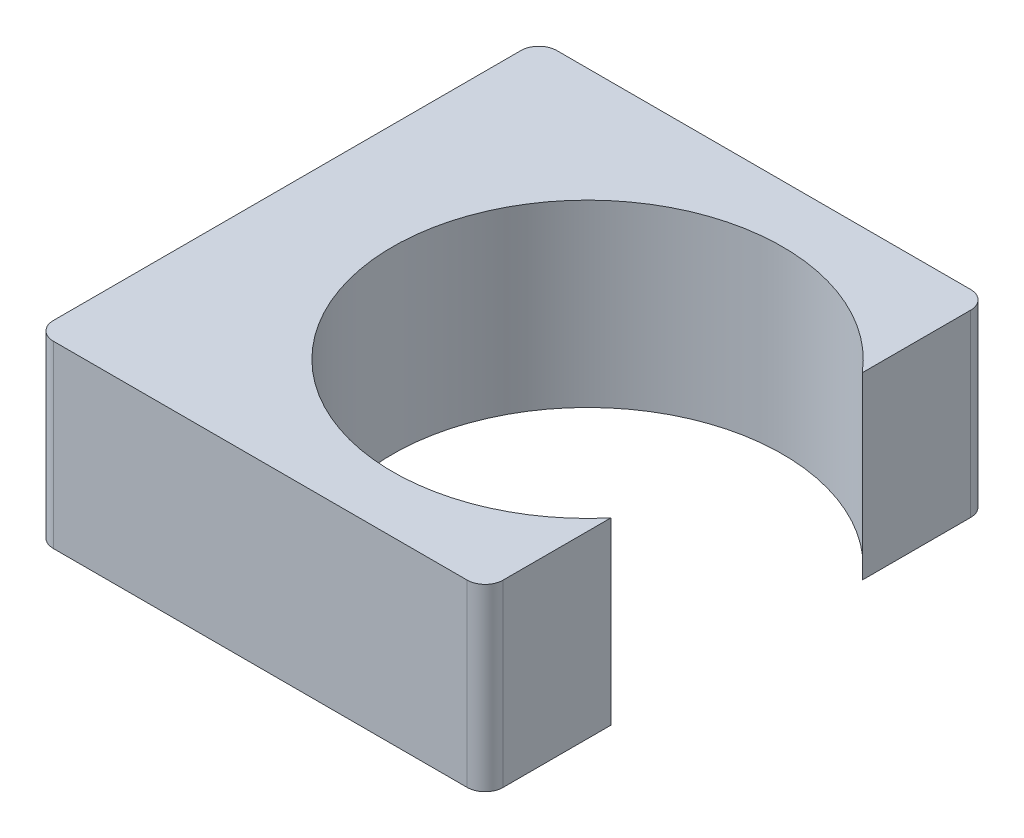
ISO-10303-21;
HEADER;
FILE_DESCRIPTION(('STEP AP214'),'2;1');
FILE_NAME('part.step','',(''),(''),'','','');
FILE_SCHEMA(('AUTOMOTIVE_DESIGN { 1 0 10303 214 1 1 1 1 }'));
ENDSEC;
DATA;
#1=APPLICATION_CONTEXT('core data for automotive mechanical design processes');
#2=APPLICATION_PROTOCOL_DEFINITION('international standard','automotive_design',2000,#1);
#3=PRODUCT_CONTEXT('',#1,'mechanical');
#4=PRODUCT('Part','Part','',(#3));
#5=PRODUCT_RELATED_PRODUCT_CATEGORY('part','',(#4));
#6=PRODUCT_DEFINITION_FORMATION('','',#4);
#7=PRODUCT_DEFINITION_CONTEXT('part definition',#1,'design');
#8=PRODUCT_DEFINITION('design','',#6,#7);
#9=PRODUCT_DEFINITION_SHAPE('','',#8);
#10=(LENGTH_UNIT() NAMED_UNIT(*) SI_UNIT(.MILLI.,.METRE.));
#11=(NAMED_UNIT(*) PLANE_ANGLE_UNIT() SI_UNIT($,.RADIAN.));
#12=(NAMED_UNIT(*) SI_UNIT($,.STERADIAN.) SOLID_ANGLE_UNIT());
#13=UNCERTAINTY_MEASURE_WITH_UNIT(LENGTH_MEASURE(1.E-05),#10,'distance_accuracy_value','');
#14=(GEOMETRIC_REPRESENTATION_CONTEXT(3) GLOBAL_UNCERTAINTY_ASSIGNED_CONTEXT((#13)) GLOBAL_UNIT_ASSIGNED_CONTEXT((#10,
#11,#12)) REPRESENTATION_CONTEXT('',''));
#15=CARTESIAN_POINT('',(0.,0.,0.));
#16=DIRECTION('',(0.,0.,1.));
#17=DIRECTION('',(1.,0.,0.));
#18=AXIS2_PLACEMENT_3D('',#15,#16,#17);
#19=CARTESIAN_POINT('',(0.,25.4,-35.6413674857204));
#20=DIRECTION('',(0.,0.,1.));
#21=DIRECTION('',(1.,0.,0.));
#22=AXIS2_PLACEMENT_3D('',#19,#20,#21);
#23=PLANE('',#22);
#24=DIRECTION('',(-1.,0.,0.));
#25=VECTOR('',#24,1.);
#26=CARTESIAN_POINT('',(0.,0.,-35.6413674857204));
#27=LINE('',#26,#25);
#28=CARTESIAN_POINT('',(18.5336586112377,0.,-35.6413674857204));
#29=VERTEX_POINT('',#28);
#30=CARTESIAN_POINT('',(-39.9904820796406,0.,-35.6413674857204));
#31=VERTEX_POINT('',#30);
#32=EDGE_CURVE('E152',#29,#31,#27,.T.);
#33=ORIENTED_EDGE('',*,*,#32,.T.);
#34=DIRECTION('',(0.,-1.,0.));
#35=VECTOR('',#34,1.);
#36=CARTESIAN_POINT('',(-39.9904820796406,25.4,-35.6413674857204));
#37=LINE('',#36,#35);
#38=CARTESIAN_POINT('',(-39.9904820796406,25.4,-35.6413674857204));
#39=VERTEX_POINT('',#38);
#40=EDGE_CURVE('E11',#39,#31,#37,.T.);
#41=ORIENTED_EDGE('',*,*,#40,.F.);
#42=DIRECTION('',(-1.,0.,0.));
#43=VECTOR('',#42,1.);
#44=CARTESIAN_POINT('',(0.,25.4,-35.6413674857204));
#45=LINE('',#44,#43);
#46=CARTESIAN_POINT('',(18.5336586112377,25.4,-35.6413674857204));
#47=VERTEX_POINT('',#46);
#48=EDGE_CURVE('E178',#47,#39,#45,.T.);
#49=ORIENTED_EDGE('',*,*,#48,.F.);
#50=DIRECTION('',(0.,-1.,0.));
#51=VECTOR('',#50,1.);
#52=CARTESIAN_POINT('',(18.5336586112377,25.4,-35.6413674857204));
#53=LINE('',#52,#51);
#54=EDGE_CURVE('E57',#47,#29,#53,.T.);
#55=ORIENTED_EDGE('',*,*,#54,.T.);
#56=EDGE_LOOP('',(#33,#41,#49,#55));
#57=FACE_BOUND('',#56,.T.);
#58=ADVANCED_FACE('F41',(#57),#23,.F.);
#59=CARTESIAN_POINT('',(-39.9904820796406,25.4,-33.1013674857204));
#60=DIRECTION('',(0.,-1.,0.));
#61=DIRECTION('',(0.,0.,-1.));
#62=AXIS2_PLACEMENT_3D('',#59,#60,#61);
#63=CYLINDRICAL_SURFACE('',#62,2.54);
#64=CARTESIAN_POINT('',(-39.9904820796406,0.,-33.1013674857204));
#65=DIRECTION('',(0.,1.,0.));
#66=DIRECTION('',(0.,0.,1.));
#67=AXIS2_PLACEMENT_3D('',#64,#65,#66);
#68=CIRCLE('',#67,2.54);
#69=CARTESIAN_POINT('',(-42.5304820796406,0.,-33.1013674857203));
#70=VERTEX_POINT('',#69);
#71=EDGE_CURVE('E154',#31,#70,#68,.T.);
#72=ORIENTED_EDGE('',*,*,#71,.T.);
#73=DIRECTION('',(0.,-1.,0.));
#74=VECTOR('',#73,1.);
#75=CARTESIAN_POINT('',(-42.5304820796406,25.4,-33.1013674857203));
#76=LINE('',#75,#74);
#77=CARTESIAN_POINT('',(-42.5304820796406,25.4,-33.1013674857203));
#78=VERTEX_POINT('',#77);
#79=EDGE_CURVE('E49',#78,#70,#76,.T.);
#80=ORIENTED_EDGE('',*,*,#79,.F.);
#81=CARTESIAN_POINT('',(-39.9904820796406,25.4,-33.1013674857204));
#82=DIRECTION('',(0.,1.,0.));
#83=DIRECTION('',(0.,0.,1.));
#84=AXIS2_PLACEMENT_3D('',#81,#82,#83);
#85=CIRCLE('',#84,2.54);
#86=EDGE_CURVE('E102',#39,#78,#85,.T.);
#87=ORIENTED_EDGE('',*,*,#86,.F.);
#88=ORIENTED_EDGE('',*,*,#40,.T.);
#89=EDGE_LOOP('',(#72,#80,#87,#88));
#90=FACE_BOUND('',#89,.T.);
#91=ADVANCED_FACE('F195',(#90),#63,.T.);
#92=CARTESIAN_POINT('',(-42.5304820796406,25.4,0.));
#93=DIRECTION('',(-1.,0.,0.));
#94=DIRECTION('',(0.,0.,1.));
#95=AXIS2_PLACEMENT_3D('',#92,#93,#94);
#96=PLANE('',#95);
#97=DIRECTION('',(0.,0.,-1.));
#98=VECTOR('',#97,1.);
#99=CARTESIAN_POINT('',(-42.5304820796406,0.,0.));
#100=LINE('',#99,#98);
#101=CARTESIAN_POINT('',(-42.5304820796406,0.,33.0225332734577));
#102=VERTEX_POINT('',#101);
#103=EDGE_CURVE('E157',#102,#70,#100,.T.);
#104=ORIENTED_EDGE('',*,*,#103,.F.);
#105=DIRECTION('',(0.,-1.,0.));
#106=VECTOR('',#105,1.);
#107=CARTESIAN_POINT('',(-42.5304820796406,25.4,33.0225332734577));
#108=LINE('',#107,#106);
#109=CARTESIAN_POINT('',(-42.5304820796406,25.4,33.0225332734577));
#110=VERTEX_POINT('',#109);
#111=EDGE_CURVE('E188',#110,#102,#108,.T.);
#112=ORIENTED_EDGE('',*,*,#111,.F.);
#113=DIRECTION('',(0.,0.,-1.));
#114=VECTOR('',#113,1.);
#115=CARTESIAN_POINT('',(-42.5304820796406,25.4,0.));
#116=LINE('',#115,#114);
#117=EDGE_CURVE('E194',#110,#78,#116,.T.);
#118=ORIENTED_EDGE('',*,*,#117,.T.);
#119=ORIENTED_EDGE('',*,*,#79,.T.);
#120=EDGE_LOOP('',(#104,#112,#118,#119));
#121=FACE_BOUND('',#120,.T.);
#122=ADVANCED_FACE('F192',(#121),#96,.T.);
#123=CARTESIAN_POINT('',(-39.9904820796406,25.4,33.0225332734577));
#124=DIRECTION('',(0.,-1.,0.));
#125=DIRECTION('',(0.,0.,-1.));
#126=AXIS2_PLACEMENT_3D('',#123,#124,#125);
#127=CYLINDRICAL_SURFACE('',#126,2.54);
#128=CARTESIAN_POINT('',(-39.9904820796406,0.,33.0225332734577));
#129=DIRECTION('',(0.,1.,0.));
#130=DIRECTION('',(0.,0.,1.));
#131=AXIS2_PLACEMENT_3D('',#128,#129,#130);
#132=CIRCLE('',#131,2.54);
#133=CARTESIAN_POINT('',(-39.9904820796406,0.,35.5625332734577));
#134=VERTEX_POINT('',#133);
#135=EDGE_CURVE('E160',#102,#134,#132,.T.);
#136=ORIENTED_EDGE('',*,*,#135,.T.);
#137=DIRECTION('',(0.,-1.,0.));
#138=VECTOR('',#137,1.);
#139=CARTESIAN_POINT('',(-39.9904820796406,25.4,35.5625332734577));
#140=LINE('',#139,#138);
#141=CARTESIAN_POINT('',(-39.9904820796406,25.4,35.5625332734577));
#142=VERTEX_POINT('',#141);
#143=EDGE_CURVE('E186',#142,#134,#140,.T.);
#144=ORIENTED_EDGE('',*,*,#143,.F.);
#145=CARTESIAN_POINT('',(-39.9904820796406,25.4,33.0225332734577));
#146=DIRECTION('',(0.,1.,0.));
#147=DIRECTION('',(0.,0.,1.));
#148=AXIS2_PLACEMENT_3D('',#145,#146,#147);
#149=CIRCLE('',#148,2.54);
#150=EDGE_CURVE('E206',#110,#142,#149,.T.);
#151=ORIENTED_EDGE('',*,*,#150,.F.);
#152=ORIENTED_EDGE('',*,*,#111,.T.);
#153=EDGE_LOOP('',(#136,#144,#151,#152));
#154=FACE_BOUND('',#153,.T.);
#155=ADVANCED_FACE('F203',(#154),#127,.T.);
#156=CARTESIAN_POINT('',(0.,25.4,35.5625332734577));
#157=DIRECTION('',(0.,0.,1.));
#158=DIRECTION('',(1.,0.,0.));
#159=AXIS2_PLACEMENT_3D('',#156,#157,#158);
#160=PLANE('',#159);
#161=DIRECTION('',(-1.,0.,0.));
#162=VECTOR('',#161,1.);
#163=CARTESIAN_POINT('',(0.,0.,35.5625332734577));
#164=LINE('',#163,#162);
#165=CARTESIAN_POINT('',(18.5336586112377,0.,35.5625332734577));
#166=VERTEX_POINT('',#165);
#167=EDGE_CURVE('E163',#166,#134,#164,.T.);
#168=ORIENTED_EDGE('',*,*,#167,.F.);
#169=DIRECTION('',(0.,-1.,0.));
#170=VECTOR('',#169,1.);
#171=CARTESIAN_POINT('',(18.5336586112377,25.4,35.5625332734577));
#172=LINE('',#171,#170);
#173=CARTESIAN_POINT('',(18.5336586112377,25.4,35.5625332734577));
#174=VERTEX_POINT('',#173);
#175=EDGE_CURVE('E184',#174,#166,#172,.T.);
#176=ORIENTED_EDGE('',*,*,#175,.F.);
#177=DIRECTION('',(-1.,0.,0.));
#178=VECTOR('',#177,1.);
#179=CARTESIAN_POINT('',(0.,25.4,35.5625332734577));
#180=LINE('',#179,#178);
#181=EDGE_CURVE('E208',#174,#142,#180,.T.);
#182=ORIENTED_EDGE('',*,*,#181,.T.);
#183=ORIENTED_EDGE('',*,*,#143,.T.);
#184=EDGE_LOOP('',(#168,#176,#182,#183));
#185=FACE_BOUND('',#184,.T.);
#186=ADVANCED_FACE('F242',(#185),#160,.T.);
#187=CARTESIAN_POINT('',(18.5336586112378,25.4,33.0225332734577));
#188=DIRECTION('',(0.,-1.,0.));
#189=DIRECTION('',(0.,0.,-1.));
#190=AXIS2_PLACEMENT_3D('',#187,#188,#189);
#191=CYLINDRICAL_SURFACE('',#190,2.54);
#192=CARTESIAN_POINT('',(18.5336586112378,0.,33.0225332734577));
#193=DIRECTION('',(0.,1.,0.));
#194=DIRECTION('',(0.,0.,1.));
#195=AXIS2_PLACEMENT_3D('',#192,#193,#194);
#196=CIRCLE('',#195,2.54);
#197=CARTESIAN_POINT('',(21.0736586112378,0.,33.0225332734577));
#198=VERTEX_POINT('',#197);
#199=EDGE_CURVE('E166',#198,#166,#196,.F.);
#200=ORIENTED_EDGE('',*,*,#199,.F.);
#201=DIRECTION('',(0.,-1.,0.));
#202=VECTOR('',#201,1.);
#203=CARTESIAN_POINT('',(21.0736586112378,25.4,33.0225332734577));
#204=LINE('',#203,#202);
#205=CARTESIAN_POINT('',(21.0736586112378,25.4,33.0225332734577));
#206=VERTEX_POINT('',#205);
#207=EDGE_CURVE('E182',#206,#198,#204,.T.);
#208=ORIENTED_EDGE('',*,*,#207,.F.);
#209=CARTESIAN_POINT('',(18.5336586112378,25.4,33.0225332734577));
#210=DIRECTION('',(0.,1.,0.));
#211=DIRECTION('',(0.,0.,1.));
#212=AXIS2_PLACEMENT_3D('',#209,#210,#211);
#213=CIRCLE('',#212,2.54);
#214=EDGE_CURVE('E147',#206,#174,#213,.F.);
#215=ORIENTED_EDGE('',*,*,#214,.T.);
#216=ORIENTED_EDGE('',*,*,#175,.T.);
#217=EDGE_LOOP('',(#200,#208,#215,#216));
#218=FACE_BOUND('',#217,.T.);
#219=ADVANCED_FACE('F217',(#218),#191,.T.);
#220=CARTESIAN_POINT('',(21.0736586112378,25.4,0.));
#221=DIRECTION('',(1.,0.,0.));
#222=DIRECTION('',(0.,0.,-1.));
#223=AXIS2_PLACEMENT_3D('',#220,#221,#222);
#224=PLANE('',#223);
#225=DIRECTION('',(0.,0.,1.));
#226=VECTOR('',#225,1.);
#227=CARTESIAN_POINT('',(21.0736586112378,0.,0.));
#228=LINE('',#227,#226);
#229=CARTESIAN_POINT('',(21.0736586112378,0.,17.78));
#230=VERTEX_POINT('',#229);
#231=EDGE_CURVE('E169',#230,#198,#228,.T.);
#232=ORIENTED_EDGE('',*,*,#231,.F.);
#233=DIRECTION('',(0.,-1.,0.));
#234=VECTOR('',#233,1.);
#235=CARTESIAN_POINT('',(21.0736586112378,25.4,17.78));
#236=LINE('',#235,#234);
#237=CARTESIAN_POINT('',(21.0736586112378,25.4,17.78));
#238=VERTEX_POINT('',#237);
#239=EDGE_CURVE('E133',#238,#230,#236,.T.);
#240=ORIENTED_EDGE('',*,*,#239,.F.);
#241=DIRECTION('',(0.,0.,1.));
#242=VECTOR('',#241,1.);
#243=CARTESIAN_POINT('',(21.0736586112378,25.4,0.));
#244=LINE('',#243,#242);
#245=EDGE_CURVE('E145',#238,#206,#244,.T.);
#246=ORIENTED_EDGE('',*,*,#245,.T.);
#247=ORIENTED_EDGE('',*,*,#207,.T.);
#248=EDGE_LOOP('',(#232,#240,#246,#247));
#249=FACE_BOUND('',#248,.T.);
#250=ADVANCED_FACE('F220',(#249),#224,.T.);
#251=CARTESIAN_POINT('',(0.,25.4,0.));
#252=DIRECTION('',(0.,-1.,0.));
#253=DIRECTION('',(0.,0.,-1.));
#254=AXIS2_PLACEMENT_3D('',#251,#252,#253);
#255=CYLINDRICAL_SURFACE('',#254,27.5722231106415);
#256=CARTESIAN_POINT('',(0.,0.,0.));
#257=DIRECTION('',(0.,1.,0.));
#258=DIRECTION('',(0.,0.,1.));
#259=AXIS2_PLACEMENT_3D('',#256,#257,#258);
#260=CIRCLE('',#259,27.5722231106415);
#261=CARTESIAN_POINT('',(21.0736586112378,0.,-17.78));
#262=VERTEX_POINT('',#261);
#263=EDGE_CURVE('E130',#262,#230,#260,.T.);
#264=ORIENTED_EDGE('',*,*,#263,.F.);
#265=DIRECTION('',(0.,-1.,0.));
#266=VECTOR('',#265,1.);
#267=CARTESIAN_POINT('',(21.0736586112378,25.4,-17.78));
#268=LINE('',#267,#266);
#269=CARTESIAN_POINT('',(21.0736586112378,25.4,-17.78));
#270=VERTEX_POINT('',#269);
#271=EDGE_CURVE('E124',#270,#262,#268,.T.);
#272=ORIENTED_EDGE('',*,*,#271,.F.);
#273=CARTESIAN_POINT('',(0.,25.4,0.));
#274=DIRECTION('',(0.,1.,0.));
#275=DIRECTION('',(0.,0.,1.));
#276=AXIS2_PLACEMENT_3D('',#273,#274,#275);
#277=CIRCLE('',#276,27.5722231106415);
#278=EDGE_CURVE('E128',#270,#238,#277,.T.);
#279=ORIENTED_EDGE('',*,*,#278,.T.);
#280=ORIENTED_EDGE('',*,*,#239,.T.);
#281=EDGE_LOOP('',(#264,#272,#279,#280));
#282=FACE_BOUND('',#281,.T.);
#283=ADVANCED_FACE('F126',(#282),#255,.F.);
#284=CARTESIAN_POINT('',(21.0736586112378,25.4,0.));
#285=DIRECTION('',(-1.,0.,0.));
#286=DIRECTION('',(0.,0.,1.));
#287=AXIS2_PLACEMENT_3D('',#284,#285,#286);
#288=PLANE('',#287);
#289=DIRECTION('',(0.,0.,-1.));
#290=VECTOR('',#289,1.);
#291=CARTESIAN_POINT('',(21.0736586112378,0.,0.));
#292=LINE('',#291,#290);
#293=CARTESIAN_POINT('',(21.0736586112378,0.,-33.1013674857203));
#294=VERTEX_POINT('',#293);
#295=EDGE_CURVE('E173',#262,#294,#292,.T.);
#296=ORIENTED_EDGE('',*,*,#295,.T.);
#297=DIRECTION('',(0.,-1.,0.));
#298=VECTOR('',#297,1.);
#299=CARTESIAN_POINT('',(21.0736586112378,25.4,-33.1013674857203));
#300=LINE('',#299,#298);
#301=CARTESIAN_POINT('',(21.0736586112378,25.4,-33.1013674857203));
#302=VERTEX_POINT('',#301);
#303=EDGE_CURVE('E90',#302,#294,#300,.T.);
#304=ORIENTED_EDGE('',*,*,#303,.F.);
#305=DIRECTION('',(0.,0.,-1.));
#306=VECTOR('',#305,1.);
#307=CARTESIAN_POINT('',(21.0736586112378,25.4,0.));
#308=LINE('',#307,#306);
#309=EDGE_CURVE('E135',#270,#302,#308,.T.);
#310=ORIENTED_EDGE('',*,*,#309,.F.);
#311=ORIENTED_EDGE('',*,*,#271,.T.);
#312=EDGE_LOOP('',(#296,#304,#310,#311));
#313=FACE_BOUND('',#312,.T.);
#314=ADVANCED_FACE('F136',(#313),#288,.F.);
#315=CARTESIAN_POINT('',(18.5336586112378,25.4,-33.1013674857204));
#316=DIRECTION('',(0.,-1.,0.));
#317=DIRECTION('',(0.,0.,-1.));
#318=AXIS2_PLACEMENT_3D('',#315,#316,#317);
#319=CYLINDRICAL_SURFACE('',#318,2.54);
#320=CARTESIAN_POINT('',(18.5336586112378,0.,-33.1013674857204));
#321=DIRECTION('',(0.,1.,0.));
#322=DIRECTION('',(0.,0.,1.));
#323=AXIS2_PLACEMENT_3D('',#320,#321,#322);
#324=CIRCLE('',#323,2.54);
#325=EDGE_CURVE('E175',#29,#294,#324,.F.);
#326=ORIENTED_EDGE('',*,*,#325,.F.);
#327=ORIENTED_EDGE('',*,*,#54,.F.);
#328=CARTESIAN_POINT('',(18.5336586112378,25.4,-33.1013674857204));
#329=DIRECTION('',(0.,1.,0.));
#330=DIRECTION('',(0.,0.,1.));
#331=AXIS2_PLACEMENT_3D('',#328,#329,#330);
#332=CIRCLE('',#331,2.54);
#333=EDGE_CURVE('E139',#47,#302,#332,.F.);
#334=ORIENTED_EDGE('',*,*,#333,.T.);
#335=ORIENTED_EDGE('',*,*,#303,.T.);
#336=EDGE_LOOP('',(#326,#327,#334,#335));
#337=FACE_BOUND('',#336,.T.);
#338=ADVANCED_FACE('F221',(#337),#319,.T.);
#339=CARTESIAN_POINT('',(0.,25.4,0.));
#340=DIRECTION('',(0.,1.,0.));
#341=DIRECTION('',(0.,0.,1.));
#342=AXIS2_PLACEMENT_3D('',#339,#340,#341);
#343=PLANE('',#342);
#344=ORIENTED_EDGE('',*,*,#48,.T.);
#345=ORIENTED_EDGE('',*,*,#86,.T.);
#346=ORIENTED_EDGE('',*,*,#117,.F.);
#347=ORIENTED_EDGE('',*,*,#150,.T.);
#348=ORIENTED_EDGE('',*,*,#181,.F.);
#349=ORIENTED_EDGE('',*,*,#214,.F.);
#350=ORIENTED_EDGE('',*,*,#245,.F.);
#351=ORIENTED_EDGE('',*,*,#278,.F.);
#352=ORIENTED_EDGE('',*,*,#309,.T.);
#353=ORIENTED_EDGE('',*,*,#333,.F.);
#354=EDGE_LOOP('',(#344,#345,#346,#347,#348,#349,#350,#351,#352,#353));
#355=FACE_BOUND('',#354,.T.);
#356=ADVANCED_FACE('F142',(#355),#343,.T.);
#357=CARTESIAN_POINT('',(0.,0.,0.));
#358=DIRECTION('',(0.,1.,0.));
#359=DIRECTION('',(0.,0.,1.));
#360=AXIS2_PLACEMENT_3D('',#357,#358,#359);
#361=PLANE('',#360);
#362=ORIENTED_EDGE('',*,*,#32,.F.);
#363=ORIENTED_EDGE('',*,*,#325,.T.);
#364=ORIENTED_EDGE('',*,*,#295,.F.);
#365=ORIENTED_EDGE('',*,*,#263,.T.);
#366=ORIENTED_EDGE('',*,*,#231,.T.);
#367=ORIENTED_EDGE('',*,*,#199,.T.);
#368=ORIENTED_EDGE('',*,*,#167,.T.);
#369=ORIENTED_EDGE('',*,*,#135,.F.);
#370=ORIENTED_EDGE('',*,*,#103,.T.);
#371=ORIENTED_EDGE('',*,*,#71,.F.);
#372=EDGE_LOOP('',(#362,#363,#364,#365,#366,#367,#368,#369,#370,#371));
#373=FACE_BOUND('',#372,.T.);
#374=ADVANCED_FACE('F199',(#373),#361,.F.);
#375=CLOSED_SHELL('',(#58,#91,#122,#155,#186,#219,#250,#283,#314,#338,#356,#374));
#376=MANIFOLD_SOLID_BREP('B2',#375);
#377=ADVANCED_BREP_SHAPE_REPRESENTATION('',(#18,#376),#14);
#378=SHAPE_DEFINITION_REPRESENTATION(#9,#377);
ENDSEC;
END-ISO-10303-21;
